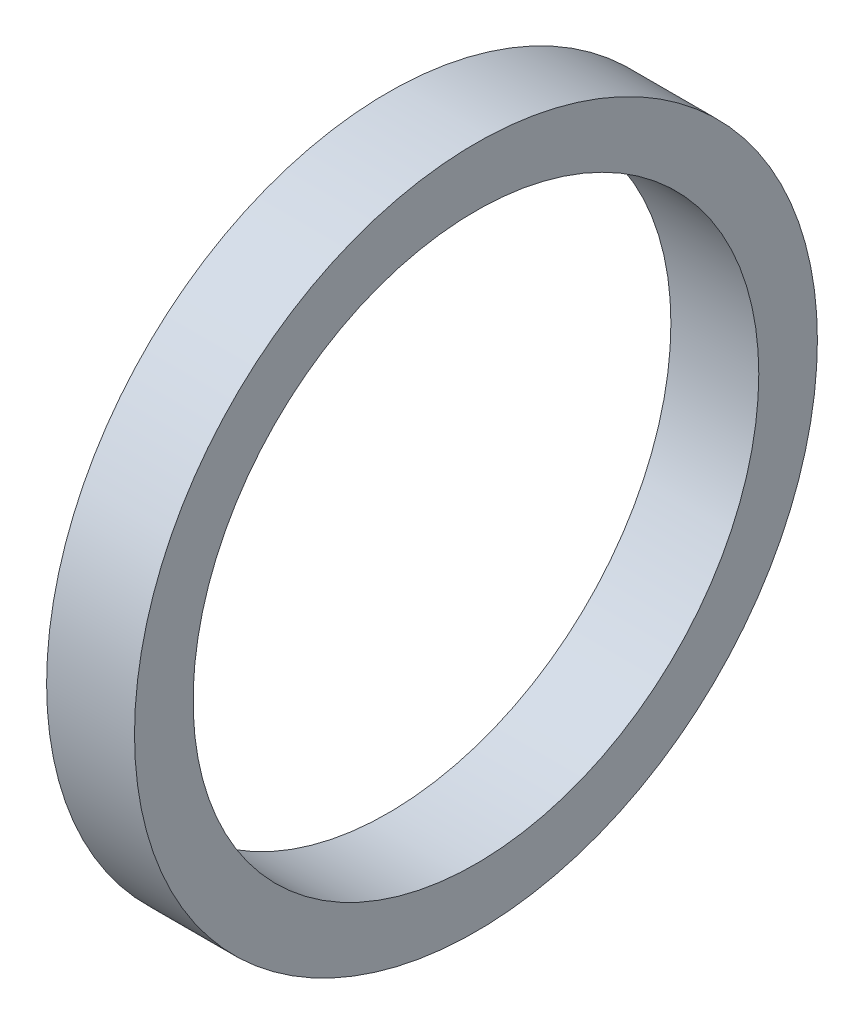
ISO-10303-21;
HEADER;
FILE_DESCRIPTION(('STEP AP214'),'2;1');
FILE_NAME('part.step','',(''),(''),'','','');
FILE_SCHEMA(('AUTOMOTIVE_DESIGN { 1 0 10303 214 1 1 1 1 }'));
ENDSEC;
DATA;
#1=APPLICATION_CONTEXT('core data for automotive mechanical design processes');
#2=APPLICATION_PROTOCOL_DEFINITION('international standard','automotive_design',2000,#1);
#3=PRODUCT_CONTEXT('',#1,'mechanical');
#4=PRODUCT('Part','Part','',(#3));
#5=PRODUCT_RELATED_PRODUCT_CATEGORY('part','',(#4));
#6=PRODUCT_DEFINITION_FORMATION('','',#4);
#7=PRODUCT_DEFINITION_CONTEXT('part definition',#1,'design');
#8=PRODUCT_DEFINITION('design','',#6,#7);
#9=PRODUCT_DEFINITION_SHAPE('','',#8);
#10=(LENGTH_UNIT() NAMED_UNIT(*) SI_UNIT(.MILLI.,.METRE.));
#11=(NAMED_UNIT(*) PLANE_ANGLE_UNIT() SI_UNIT($,.RADIAN.));
#12=(NAMED_UNIT(*) SI_UNIT($,.STERADIAN.) SOLID_ANGLE_UNIT());
#13=UNCERTAINTY_MEASURE_WITH_UNIT(LENGTH_MEASURE(1.E-05),#10,'distance_accuracy_value','');
#14=(GEOMETRIC_REPRESENTATION_CONTEXT(3) GLOBAL_UNCERTAINTY_ASSIGNED_CONTEXT((#13)) GLOBAL_UNIT_ASSIGNED_CONTEXT((#10,
#11,#12)) REPRESENTATION_CONTEXT('',''));
#15=CARTESIAN_POINT('',(0.,0.,0.));
#16=DIRECTION('',(0.,0.,1.));
#17=DIRECTION('',(1.,0.,0.));
#18=AXIS2_PLACEMENT_3D('',#15,#16,#17);
#19=CARTESIAN_POINT('',(25.716228569532,0.,0.));
#20=DIRECTION('',(1.,0.,0.));
#21=DIRECTION('',(0.,0.,-1.));
#22=AXIS2_PLACEMENT_3D('',#19,#20,#21);
#23=CYLINDRICAL_SURFACE('',#22,18.499999957);
#24=CARTESIAN_POINT('',(-111.71250008,0.,0.));
#25=DIRECTION('',(1.,0.,0.));
#26=DIRECTION('',(0.,0.,-1.));
#27=AXIS2_PLACEMENT_3D('',#24,#25,#26);
#28=CIRCLE('',#27,18.499999957);
#29=CARTESIAN_POINT('',(-111.71250008,0.,-18.499999957));
#30=VERTEX_POINT('',#29);
#31=EDGE_CURVE('E10',#30,#30,#28,.T.);
#32=ORIENTED_EDGE('',*,*,#31,.T.);
#33=EDGE_LOOP('',(#32));
#34=FACE_BOUND('',#33,.T.);
#35=CARTESIAN_POINT('',(-106.95000008,0.,0.));
#36=DIRECTION('',(1.,0.,0.));
#37=DIRECTION('',(0.,0.,-1.));
#38=AXIS2_PLACEMENT_3D('',#35,#36,#37);
#39=CIRCLE('',#38,18.499999957);
#40=CARTESIAN_POINT('',(-106.95000008,0.,-18.499999957));
#41=VERTEX_POINT('',#40);
#42=EDGE_CURVE('E47',#41,#41,#39,.T.);
#43=ORIENTED_EDGE('',*,*,#42,.F.);
#44=EDGE_LOOP('',(#43));
#45=FACE_BOUND('',#44,.T.);
#46=ADVANCED_FACE('F33',(#34,#45),#23,.T.);
#47=CARTESIAN_POINT('',(-111.71250008,0.,0.));
#48=DIRECTION('',(-1.,0.,0.));
#49=DIRECTION('',(0.,0.,1.));
#50=AXIS2_PLACEMENT_3D('',#47,#48,#49);
#51=PLANE('',#50);
#52=CARTESIAN_POINT('',(-111.71250008,0.,0.));
#53=DIRECTION('',(1.,0.,0.));
#54=DIRECTION('',(0.,0.,-1.));
#55=AXIS2_PLACEMENT_3D('',#52,#53,#54);
#56=CIRCLE('',#55,15.324999957);
#57=CARTESIAN_POINT('',(-111.71250008,0.,-15.324999957));
#58=VERTEX_POINT('',#57);
#59=EDGE_CURVE('E39',#58,#58,#56,.T.);
#60=ORIENTED_EDGE('',*,*,#59,.T.);
#61=EDGE_LOOP('',(#60));
#62=FACE_BOUND('',#61,.T.);
#63=ORIENTED_EDGE('',*,*,#31,.F.);
#64=EDGE_LOOP('',(#63));
#65=FACE_BOUND('',#64,.T.);
#66=ADVANCED_FACE('F56',(#62,#65),#51,.T.);
#67=CARTESIAN_POINT('',(25.716228569532,0.,0.));
#68=DIRECTION('',(1.,0.,0.));
#69=DIRECTION('',(0.,0.,-1.));
#70=AXIS2_PLACEMENT_3D('',#67,#68,#69);
#71=CYLINDRICAL_SURFACE('',#70,15.324999957);
#72=ORIENTED_EDGE('',*,*,#59,.F.);
#73=EDGE_LOOP('',(#72));
#74=FACE_BOUND('',#73,.T.);
#75=CARTESIAN_POINT('',(-106.95000008,0.,0.));
#76=DIRECTION('',(1.,0.,0.));
#77=DIRECTION('',(0.,0.,-1.));
#78=AXIS2_PLACEMENT_3D('',#75,#76,#77);
#79=CIRCLE('',#78,15.324999957);
#80=CARTESIAN_POINT('',(-106.95000008,0.,-15.324999957));
#81=VERTEX_POINT('',#80);
#82=EDGE_CURVE('E43',#81,#81,#79,.T.);
#83=ORIENTED_EDGE('',*,*,#82,.T.);
#84=EDGE_LOOP('',(#83));
#85=FACE_BOUND('',#84,.T.);
#86=ADVANCED_FACE('F60',(#74,#85),#71,.F.);
#87=CARTESIAN_POINT('',(-106.95000008,0.,0.));
#88=DIRECTION('',(-1.,0.,0.));
#89=DIRECTION('',(0.,0.,1.));
#90=AXIS2_PLACEMENT_3D('',#87,#88,#89);
#91=PLANE('',#90);
#92=ORIENTED_EDGE('',*,*,#82,.F.);
#93=EDGE_LOOP('',(#92));
#94=FACE_BOUND('',#93,.T.);
#95=ORIENTED_EDGE('',*,*,#42,.T.);
#96=EDGE_LOOP('',(#95));
#97=FACE_BOUND('',#96,.T.);
#98=ADVANCED_FACE('F53',(#94,#97),#91,.F.);
#99=CLOSED_SHELL('',(#46,#66,#86,#98));
#100=MANIFOLD_SOLID_BREP('B2',#99);
#101=ADVANCED_BREP_SHAPE_REPRESENTATION('',(#18,#100),#14);
#102=SHAPE_DEFINITION_REPRESENTATION(#9,#101);
ENDSEC;
END-ISO-10303-21;
